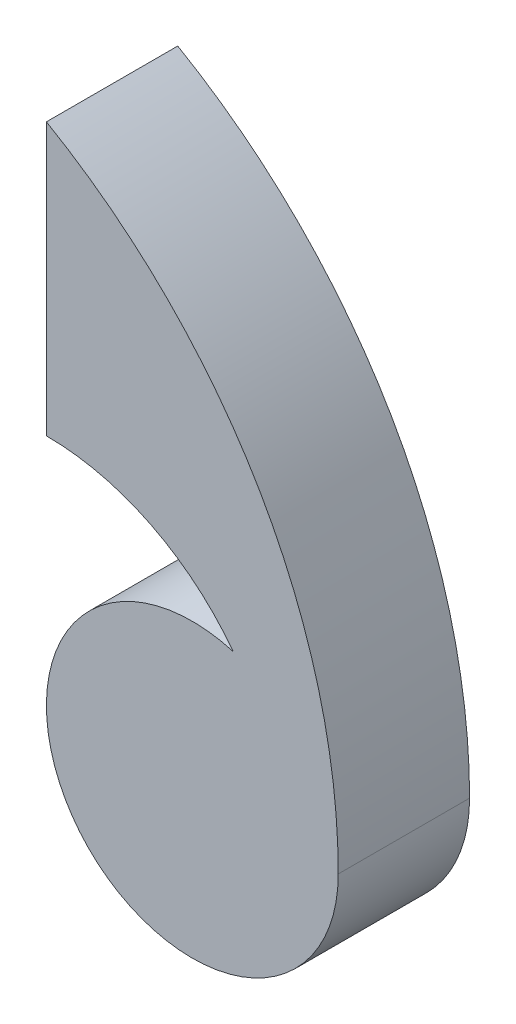
ISO-10303-21;
HEADER;
FILE_DESCRIPTION(('STEP AP214'),'2;1');
FILE_NAME('part.step','',(''),(''),'','','');
FILE_SCHEMA(('AUTOMOTIVE_DESIGN { 1 0 10303 214 1 1 1 1 }'));
ENDSEC;
DATA;
#1=APPLICATION_CONTEXT('core data for automotive mechanical design processes');
#2=APPLICATION_PROTOCOL_DEFINITION('international standard','automotive_design',2000,#1);
#3=PRODUCT_CONTEXT('',#1,'mechanical');
#4=PRODUCT('Part','Part','',(#3));
#5=PRODUCT_RELATED_PRODUCT_CATEGORY('part','',(#4));
#6=PRODUCT_DEFINITION_FORMATION('','',#4);
#7=PRODUCT_DEFINITION_CONTEXT('part definition',#1,'design');
#8=PRODUCT_DEFINITION('design','',#6,#7);
#9=PRODUCT_DEFINITION_SHAPE('','',#8);
#10=(LENGTH_UNIT() NAMED_UNIT(*) SI_UNIT(.MILLI.,.METRE.));
#11=(NAMED_UNIT(*) PLANE_ANGLE_UNIT() SI_UNIT($,.RADIAN.));
#12=(NAMED_UNIT(*) SI_UNIT($,.STERADIAN.) SOLID_ANGLE_UNIT());
#13=UNCERTAINTY_MEASURE_WITH_UNIT(LENGTH_MEASURE(1.E-05),#10,'distance_accuracy_value','');
#14=(GEOMETRIC_REPRESENTATION_CONTEXT(3) GLOBAL_UNCERTAINTY_ASSIGNED_CONTEXT((#13)) GLOBAL_UNIT_ASSIGNED_CONTEXT((#10,
#11,#12)) REPRESENTATION_CONTEXT('',''));
#15=CARTESIAN_POINT('',(0.,0.,0.));
#16=DIRECTION('',(0.,0.,1.));
#17=DIRECTION('',(1.,0.,0.));
#18=AXIS2_PLACEMENT_3D('',#15,#16,#17);
#19=CARTESIAN_POINT('',(0.,0.,18.));
#20=DIRECTION('',(0.,0.,-1.));
#21=DIRECTION('',(-1.,0.,0.));
#22=AXIS2_PLACEMENT_3D('',#19,#20,#21);
#23=CYLINDRICAL_SURFACE('',#22,20.);
#24=CARTESIAN_POINT('',(0.,0.,0.));
#25=DIRECTION('',(0.,0.,1.));
#26=DIRECTION('',(1.,0.,0.));
#27=AXIS2_PLACEMENT_3D('',#24,#25,#26);
#28=CIRCLE('',#27,20.);
#29=CARTESIAN_POINT('',(5.6,19.2,0.));
#30=VERTEX_POINT('',#29);
#31=CARTESIAN_POINT('',(20.,0.,0.));
#32=VERTEX_POINT('',#31);
#33=EDGE_CURVE('E42',#30,#32,#28,.T.);
#34=ORIENTED_EDGE('',*,*,#33,.T.);
#35=DIRECTION('',(0.,0.,1.));
#36=VECTOR('',#35,1.);
#37=CARTESIAN_POINT('',(20.,0.,-80.));
#38=LINE('',#37,#36);
#39=CARTESIAN_POINT('',(20.,0.,18.));
#40=VERTEX_POINT('',#39);
#41=EDGE_CURVE('E56',#32,#40,#38,.T.);
#42=ORIENTED_EDGE('',*,*,#41,.T.);
#43=CARTESIAN_POINT('',(0.,0.,18.));
#44=DIRECTION('',(0.,0.,1.));
#45=DIRECTION('',(1.,0.,0.));
#46=AXIS2_PLACEMENT_3D('',#43,#44,#45);
#47=CIRCLE('',#46,20.);
#48=CARTESIAN_POINT('',(5.6,19.2,18.));
#49=VERTEX_POINT('',#48);
#50=EDGE_CURVE('E11',#49,#40,#47,.T.);
#51=ORIENTED_EDGE('',*,*,#50,.F.);
#52=DIRECTION('',(0.,0.,1.));
#53=VECTOR('',#52,1.);
#54=CARTESIAN_POINT('',(5.6,19.2,8.99999999999999));
#55=LINE('',#54,#53);
#56=EDGE_CURVE('E108',#49,#30,#55,.F.);
#57=ORIENTED_EDGE('',*,*,#56,.T.);
#58=EDGE_LOOP('',(#34,#42,#51,#57));
#59=FACE_BOUND('',#58,.T.);
#60=ADVANCED_FACE('F39',(#59),#23,.T.);
#61=CARTESIAN_POINT('',(0.,0.,18.));
#62=DIRECTION('',(0.,0.,1.));
#63=DIRECTION('',(1.,0.,0.));
#64=AXIS2_PLACEMENT_3D('',#61,#62,#63);
#65=PLANE('',#64);
#66=ORIENTED_EDGE('',*,*,#50,.T.);
#67=CARTESIAN_POINT('',(-60.,0.,18.));
#68=DIRECTION('',(0.,0.,1.));
#69=DIRECTION('',(1.,0.,0.));
#70=AXIS2_PLACEMENT_3D('',#67,#68,#69);
#71=CIRCLE('',#70,80.);
#72=CARTESIAN_POINT('',(-20.,69.2820323027551,18.));
#73=VERTEX_POINT('',#72);
#74=EDGE_CURVE('E81',#40,#73,#71,.T.);
#75=ORIENTED_EDGE('',*,*,#74,.T.);
#76=DIRECTION('',(0.,-1.,0.));
#77=VECTOR('',#76,1.);
#78=CARTESIAN_POINT('',(-20.,69.2820323027551,18.));
#79=LINE('',#78,#77);
#80=CARTESIAN_POINT('',(-20.,32.,18.));
#81=VERTEX_POINT('',#80);
#82=EDGE_CURVE('E90',#73,#81,#79,.T.);
#83=ORIENTED_EDGE('',*,*,#82,.T.);
#84=CARTESIAN_POINT('',(-20.,0.,18.));
#85=DIRECTION('',(0.,0.,-1.));
#86=DIRECTION('',(-1.,0.,0.));
#87=AXIS2_PLACEMENT_3D('',#84,#85,#86);
#88=CIRCLE('',#87,32.);
#89=EDGE_CURVE('E87',#81,#49,#88,.T.);
#90=ORIENTED_EDGE('',*,*,#89,.T.);
#91=EDGE_LOOP('',(#66,#75,#83,#90));
#92=FACE_BOUND('',#91,.T.);
#93=ADVANCED_FACE('F97',(#92),#65,.T.);
#94=CARTESIAN_POINT('',(0.,0.,0.));
#95=DIRECTION('',(0.,0.,1.));
#96=DIRECTION('',(1.,0.,0.));
#97=AXIS2_PLACEMENT_3D('',#94,#95,#96);
#98=PLANE('',#97);
#99=ORIENTED_EDGE('',*,*,#33,.F.);
#100=CARTESIAN_POINT('',(-20.,0.,0.));
#101=DIRECTION('',(0.,0.,1.));
#102=DIRECTION('',(1.,0.,0.));
#103=AXIS2_PLACEMENT_3D('',#100,#101,#102);
#104=CIRCLE('',#103,32.);
#105=CARTESIAN_POINT('',(-20.,32.,0.));
#106=VERTEX_POINT('',#105);
#107=EDGE_CURVE('E104',#30,#106,#104,.T.);
#108=ORIENTED_EDGE('',*,*,#107,.T.);
#109=DIRECTION('',(0.,1.,0.));
#110=VECTOR('',#109,1.);
#111=CARTESIAN_POINT('',(-20.,69.2820323027551,0.));
#112=LINE('',#111,#110);
#113=CARTESIAN_POINT('',(-20.,69.2820323027551,0.));
#114=VERTEX_POINT('',#113);
#115=EDGE_CURVE('E106',#106,#114,#112,.T.);
#116=ORIENTED_EDGE('',*,*,#115,.T.);
#117=CARTESIAN_POINT('',(-60.,0.,0.));
#118=DIRECTION('',(0.,0.,1.));
#119=DIRECTION('',(1.,0.,0.));
#120=AXIS2_PLACEMENT_3D('',#117,#118,#119);
#121=CIRCLE('',#120,80.);
#122=EDGE_CURVE('E83',#114,#32,#121,.F.);
#123=ORIENTED_EDGE('',*,*,#122,.T.);
#124=EDGE_LOOP('',(#99,#108,#116,#123));
#125=FACE_BOUND('',#124,.T.);
#126=ADVANCED_FACE('F111',(#125),#98,.F.);
#127=CARTESIAN_POINT('',(-20.,0.,-80.));
#128=DIRECTION('',(0.,0.,1.));
#129=DIRECTION('',(1.,0.,0.));
#130=AXIS2_PLACEMENT_3D('',#127,#128,#129);
#131=CYLINDRICAL_SURFACE('',#130,32.);
#132=ORIENTED_EDGE('',*,*,#56,.F.);
#133=ORIENTED_EDGE('',*,*,#89,.F.);
#134=DIRECTION('',(0.,0.,1.));
#135=VECTOR('',#134,1.);
#136=CARTESIAN_POINT('',(-20.,32.,-80.));
#137=LINE('',#136,#135);
#138=EDGE_CURVE('E86',#106,#81,#137,.T.);
#139=ORIENTED_EDGE('',*,*,#138,.F.);
#140=ORIENTED_EDGE('',*,*,#107,.F.);
#141=EDGE_LOOP('',(#132,#133,#139,#140));
#142=FACE_BOUND('',#141,.T.);
#143=ADVANCED_FACE('F113',(#142),#131,.F.);
#144=CARTESIAN_POINT('',(-60.,0.,-80.));
#145=DIRECTION('',(0.,0.,1.));
#146=DIRECTION('',(1.,0.,0.));
#147=AXIS2_PLACEMENT_3D('',#144,#145,#146);
#148=CYLINDRICAL_SURFACE('',#147,80.);
#149=ORIENTED_EDGE('',*,*,#122,.F.);
#150=DIRECTION('',(0.,0.,1.));
#151=VECTOR('',#150,1.);
#152=CARTESIAN_POINT('',(-20.,69.2820323027551,-80.));
#153=LINE('',#152,#151);
#154=EDGE_CURVE('E77',#114,#73,#153,.T.);
#155=ORIENTED_EDGE('',*,*,#154,.T.);
#156=ORIENTED_EDGE('',*,*,#74,.F.);
#157=ORIENTED_EDGE('',*,*,#41,.F.);
#158=EDGE_LOOP('',(#149,#155,#156,#157));
#159=FACE_BOUND('',#158,.T.);
#160=ADVANCED_FACE('F79',(#159),#148,.T.);
#161=CARTESIAN_POINT('',(-20.,69.2820323027551,-80.));
#162=DIRECTION('',(-1.,0.,0.));
#163=DIRECTION('',(0.,-1.,0.));
#164=AXIS2_PLACEMENT_3D('',#161,#162,#163);
#165=PLANE('',#164);
#166=ORIENTED_EDGE('',*,*,#115,.F.);
#167=ORIENTED_EDGE('',*,*,#138,.T.);
#168=ORIENTED_EDGE('',*,*,#82,.F.);
#169=ORIENTED_EDGE('',*,*,#154,.F.);
#170=EDGE_LOOP('',(#166,#167,#168,#169));
#171=FACE_BOUND('',#170,.T.);
#172=ADVANCED_FACE('F91',(#171),#165,.T.);
#173=CLOSED_SHELL('',(#60,#93,#126,#143,#160,#172));
#174=MANIFOLD_SOLID_BREP('B2',#173);
#175=ADVANCED_BREP_SHAPE_REPRESENTATION('',(#18,#174),#14);
#176=SHAPE_DEFINITION_REPRESENTATION(#9,#175);
ENDSEC;
END-ISO-10303-21;
